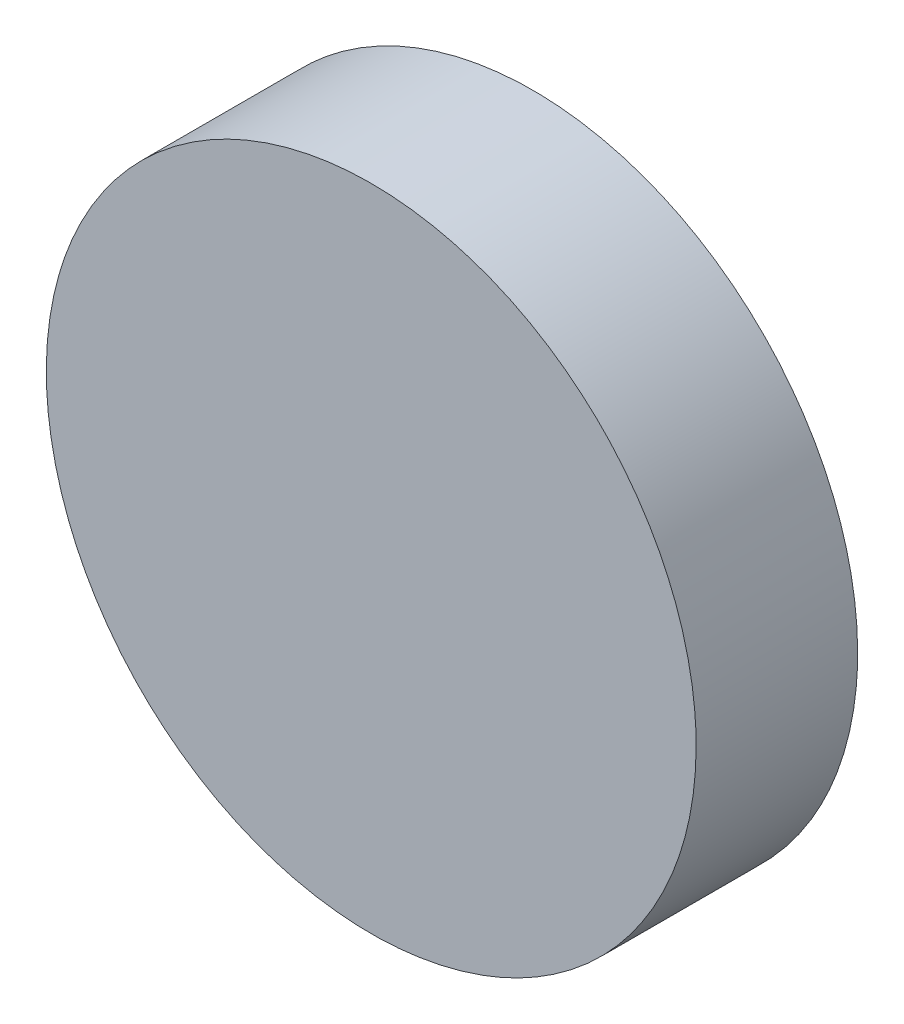
ISO-10303-21;
HEADER;
FILE_DESCRIPTION(('STEP AP214'),'2;1');
FILE_NAME('part.step','',(''),(''),'','','');
FILE_SCHEMA(('AUTOMOTIVE_DESIGN { 1 0 10303 214 1 1 1 1 }'));
ENDSEC;
DATA;
#1=APPLICATION_CONTEXT('core data for automotive mechanical design processes');
#2=APPLICATION_PROTOCOL_DEFINITION('international standard','automotive_design',2000,#1);
#3=PRODUCT_CONTEXT('',#1,'mechanical');
#4=PRODUCT('Part','Part','',(#3));
#5=PRODUCT_RELATED_PRODUCT_CATEGORY('part','',(#4));
#6=PRODUCT_DEFINITION_FORMATION('','',#4);
#7=PRODUCT_DEFINITION_CONTEXT('part definition',#1,'design');
#8=PRODUCT_DEFINITION('design','',#6,#7);
#9=PRODUCT_DEFINITION_SHAPE('','',#8);
#10=(LENGTH_UNIT() NAMED_UNIT(*) SI_UNIT(.MILLI.,.METRE.));
#11=(NAMED_UNIT(*) PLANE_ANGLE_UNIT() SI_UNIT($,.RADIAN.));
#12=(NAMED_UNIT(*) SI_UNIT($,.STERADIAN.) SOLID_ANGLE_UNIT());
#13=UNCERTAINTY_MEASURE_WITH_UNIT(LENGTH_MEASURE(1.E-05),#10,'distance_accuracy_value','');
#14=(GEOMETRIC_REPRESENTATION_CONTEXT(3) GLOBAL_UNCERTAINTY_ASSIGNED_CONTEXT((#13)) GLOBAL_UNIT_ASSIGNED_CONTEXT((#10,
#11,#12)) REPRESENTATION_CONTEXT('',''));
#15=CARTESIAN_POINT('',(0.,0.,0.));
#16=DIRECTION('',(0.,0.,1.));
#17=DIRECTION('',(1.,0.,0.));
#18=AXIS2_PLACEMENT_3D('',#15,#16,#17);
#19=CARTESIAN_POINT('',(-13.1496363943217,2.89844450659047,33.9766497664763));
#20=CARTESIAN_POINT('',(-13.1496363943217,3.16761247332292,33.9766497664763));
#21=CARTESIAN_POINT('',(-13.2567180692927,3.70594840678783,33.9766497664763));
#22=CARTESIAN_POINT('',(-13.7141322851876,4.39051715822122,33.9766497664763));
#23=CARTESIAN_POINT('',(-14.398701036621,4.8479313741161,33.9766497664763));
#24=CARTESIAN_POINT('',(-15.2062049368183,5.00855388657266,33.9766497664763));
#25=CARTESIAN_POINT('',(-16.0137088370157,4.8479313741161,33.9766497664763));
#26=CARTESIAN_POINT('',(-16.6982775884491,4.39051715822122,33.9766497664763));
#27=CARTESIAN_POINT('',(-17.155691804344,3.70594840678783,33.9766497664763));
#28=CARTESIAN_POINT('',(-17.3163143168005,2.89844450659047,33.9766497664763));
#29=CARTESIAN_POINT('',(-17.155691804344,2.09094060639311,33.9766497664763));
#30=CARTESIAN_POINT('',(-16.6982775884491,1.40637185495972,33.9766497664763));
#31=CARTESIAN_POINT('',(-16.0137088370157,0.948957639064841,33.9766497664763));
#32=CARTESIAN_POINT('',(-15.2062049368183,0.788335126608277,33.9766497664763));
#33=CARTESIAN_POINT('',(-14.398701036621,0.948957639064841,33.9766497664763));
#34=CARTESIAN_POINT('',(-13.7141322851876,1.40637185495972,33.9766497664763));
#35=CARTESIAN_POINT('',(-13.2567180692927,2.09094060639311,33.9766497664763));
#36=CARTESIAN_POINT('',(-13.1496363943217,2.62927653985802,33.9766497664763));
#37=CARTESIAN_POINT('',(-13.1496363943217,2.89844450659047,33.9766497664763));
#38=B_SPLINE_CURVE_WITH_KNOTS('',3,(#19,#20,#21,#22,#23,#24,#25,#26,#27,#28,#29,#30,#31,#32,#33,
#34,#35,#36,#37),.UNSPECIFIED.,.T.,.F.,(4,1,1,1,1,1,1,1,1,1,1,1,1,1,1,1,4),(0.,0.0625,0.125,
0.1875,0.25,0.3125,0.375,0.4375,0.5,0.5625,0.625,0.6875,0.75,0.8125,0.875,0.9375,1.),.UNSPECIFIED.);
#39=DIRECTION('',(0.,0.,1.));
#40=VECTOR('',#39,1.);
#41=SURFACE_OF_LINEAR_EXTRUSION('',#38,#40);
#42=CARTESIAN_POINT('',(-13.1496363943217,2.89844450659047,33.9766497664763));
#43=CARTESIAN_POINT('',(-13.1496363943217,3.16761247332292,33.9766497664763));
#44=CARTESIAN_POINT('',(-13.2567180692927,3.70594840678783,33.9766497664763));
#45=CARTESIAN_POINT('',(-13.7141322851876,4.39051715822122,33.9766497664763));
#46=CARTESIAN_POINT('',(-14.398701036621,4.8479313741161,33.9766497664763));
#47=CARTESIAN_POINT('',(-15.2062049368183,5.00855388657266,33.9766497664763));
#48=CARTESIAN_POINT('',(-16.0137088370157,4.8479313741161,33.9766497664763));
#49=CARTESIAN_POINT('',(-16.6982775884491,4.39051715822122,33.9766497664763));
#50=CARTESIAN_POINT('',(-17.155691804344,3.70594840678783,33.9766497664763));
#51=CARTESIAN_POINT('',(-17.3163143168005,2.89844450659047,33.9766497664763));
#52=CARTESIAN_POINT('',(-17.155691804344,2.09094060639311,33.9766497664763));
#53=CARTESIAN_POINT('',(-16.6982775884491,1.40637185495972,33.9766497664763));
#54=CARTESIAN_POINT('',(-16.0137088370157,0.948957639064841,33.9766497664763));
#55=CARTESIAN_POINT('',(-15.2062049368183,0.788335126608277,33.9766497664763));
#56=CARTESIAN_POINT('',(-14.398701036621,0.948957639064841,33.9766497664763));
#57=CARTESIAN_POINT('',(-13.7141322851876,1.40637185495972,33.9766497664763));
#58=CARTESIAN_POINT('',(-13.2567180692927,2.09094060639311,33.9766497664763));
#59=CARTESIAN_POINT('',(-13.1496363943217,2.62927653985802,33.9766497664763));
#60=CARTESIAN_POINT('',(-13.1496363943217,2.89844450659047,33.9766497664763));
#61=B_SPLINE_CURVE_WITH_KNOTS('',3,(#42,#43,#44,#45,#46,#47,#48,#49,#50,#51,#52,#53,#54,#55,#56,
#57,#58,#59,#60),.UNSPECIFIED.,.T.,.F.,(4,1,1,1,1,1,1,1,1,1,1,1,1,1,1,1,4),(0.,0.0625,0.125,
0.1875,0.25,0.3125,0.375,0.4375,0.5,0.5625,0.625,0.6875,0.75,0.8125,0.875,0.9375,1.),.UNSPECIFIED.);
#62=CARTESIAN_POINT('',(-13.1496363943217,2.89844450659047,33.9766497664763));
#63=VERTEX_POINT('',#62);
#64=EDGE_CURVE('E9',#63,#63,#61,.T.);
#65=ORIENTED_EDGE('',*,*,#64,.T.);
#66=EDGE_LOOP('',(#65));
#67=FACE_BOUND('',#66,.T.);
#68=CARTESIAN_POINT('',(-13.1496363943217,2.89844450659047,34.9990000000068));
#69=CARTESIAN_POINT('',(-13.1496363699629,2.86479771684749,34.9990000000068));
#70=CARTESIAN_POINT('',(-13.1504730064724,2.83115162548501,34.9990000000068));
#71=CARTESIAN_POINT('',(-13.1538034135198,2.76393947146804,34.9990000000068));
#72=CARTESIAN_POINT('',(-13.1562972815486,2.73037341363833,34.9990000000068));
#73=CARTESIAN_POINT('',(-13.1629261875652,2.66340163862288,34.9990000000068));
#74=CARTESIAN_POINT('',(-13.1670613381745,2.62999593259941,34.9990000000068));
#75=CARTESIAN_POINT('',(-13.1769569019658,2.56342468915356,34.9990000000068));
#76=CARTESIAN_POINT('',(-13.1827173852433,2.53025916215264,34.9990000000068));
#77=CARTESIAN_POINT('',(-13.1958477712335,2.46424824869611,34.9990000000068));
#78=CARTESIAN_POINT('',(-13.2032176739464,2.43140286224051,34.9990000000068));
#79=CARTESIAN_POINT('',(-13.2195510839073,2.36611217178674,34.9990000000068));
#80=CARTESIAN_POINT('',(-13.2285145224069,2.33366685059351,34.9990000000068));
#81=CARTESIAN_POINT('',(-13.2480191751394,2.26925627775602,34.9990000000068));
#82=CARTESIAN_POINT('',(-13.2585602810548,2.23729099331971,34.9990000000068));
#83=CARTESIAN_POINT('',(-13.2812044587058,2.17392037371882,34.9990000000068));
#84=CARTESIAN_POINT('',(-13.2933074385154,2.14251500572341,34.9990000000068));
#85=CARTESIAN_POINT('',(-13.3190592678828,2.08034458998414,34.9990000000068));
#86=CARTESIAN_POINT('',(-13.3327081174406,2.04957954224029,34.9990000000068));
#87=CARTESIAN_POINT('',(-13.3615060607773,1.98875789577373,34.9990000000068));
#88=CARTESIAN_POINT('',(-13.3766552427726,1.95870133883757,34.9990000000068));
#89=CARTESIAN_POINT('',(-13.4084085231704,1.89936431398903,34.9990000000068));
#90=CARTESIAN_POINT('',(-13.4250127213523,1.87008389948112,34.9990000000068));
#91=CARTESIAN_POINT('',(-13.4596307472126,1.8123669438299,34.9990000000068));
#92=CARTESIAN_POINT('',(-13.4776446356623,1.78393043914022,34.9990000000068));
#93=CARTESIAN_POINT('',(-13.5150368121087,1.72796909239188,34.9990000000068));
#94=CARTESIAN_POINT('',(-13.5344151001053,1.70044425033323,34.9990000000068));
#95=CARTESIAN_POINT('',(-13.5744908691528,1.64637404209053,34.9990000000068));
#96=CARTESIAN_POINT('',(-13.5951882932687,1.61982863371135,34.9990000000068));
#97=CARTESIAN_POINT('',(-13.6378571017135,1.56778513152689,34.9990000000068));
#98=CARTESIAN_POINT('',(-13.6598283985191,1.54228696597445,34.9990000000068));
#99=CARTESIAN_POINT('',(-13.7049997770275,1.49240569911345,34.9990000000068));
#100=CARTESIAN_POINT('',(-13.7281997863655,1.46802253229461,34.9990000000068));
#101=CARTESIAN_POINT('',(-13.7757829625225,1.42043935613767,34.9990000000068));
#102=CARTESIAN_POINT('',(-13.8001661293413,1.39723934679959,34.9990000000068));
#103=CARTESIAN_POINT('',(-13.8500473962023,1.3520679682912,34.9990000000068));
#104=CARTESIAN_POINT('',(-13.8755455617548,1.33009667148559,34.9990000000068));
#105=CARTESIAN_POINT('',(-13.9275890639392,1.28742786304083,34.9990000000068));
#106=CARTESIAN_POINT('',(-13.9541344723184,1.26673043892492,34.9990000000068));
#107=CARTESIAN_POINT('',(-14.0082046805611,1.22665466987745,34.9990000000068));
#108=CARTESIAN_POINT('',(-14.0357295226198,1.20727638188081,34.9990000000068));
#109=CARTESIAN_POINT('',(-14.091690869368,1.16988420543445,34.9990000000068));
#110=CARTESIAN_POINT('',(-14.1201273740576,1.15187031698473,34.9990000000068));
#111=CARTESIAN_POINT('',(-14.1778443297092,1.1172522911244,34.9990000000068));
#112=CARTESIAN_POINT('',(-14.2071247442177,1.10064809294253,34.9990000000068));
#113=CARTESIAN_POINT('',(-14.2664617690647,1.06889481254468,34.9990000000068));
#114=CARTESIAN_POINT('',(-14.2965183259987,1.05374563054928,34.9990000000068));
#115=CARTESIAN_POINT('',(-14.357339972471,1.02494768721292,34.9990000000068));
#116=CARTESIAN_POINT('',(-14.3881050202227,1.01129883765558,34.9990000000068));
#117=CARTESIAN_POINT('',(-14.4502754359406,0.985547008286876,34.9990000000068));
#118=CARTESIAN_POINT('',(-14.4816808039067,0.973444028475515,34.9990000000068));
#119=CARTESIAN_POINT('',(-14.5450514235876,0.950799850829384,34.9990000000068));
#120=CARTESIAN_POINT('',(-14.5770167081331,0.940258744920572,34.9990000000068));
#121=CARTESIAN_POINT('',(-14.6414272806721,0.920754092170061,34.9990000000068));
#122=CARTESIAN_POINT('',(-14.6738726014576,0.911790653645731,34.9990000000068));
#123=CARTESIAN_POINT('',(-14.7391632930254,0.895457243752155,34.9990000000068));
#124=CARTESIAN_POINT('',(-14.772008681003,0.888087341131276,34.9990000000068));
#125=CARTESIAN_POINT('',(-14.8380195903015,0.874956954889819,34.9990000000068));
#126=CARTESIAN_POINT('',(-14.8711851116225,0.869196471269239,34.9990000000068));
#127=CARTESIAN_POINT('',(-14.9377563705859,0.85930090841536,34.9990000000068));
#128=CARTESIAN_POINT('',(-14.9711620978056,0.855165759086547,34.9990000000068));
#129=CARTESIAN_POINT('',(-15.0381338149133,0.84853684957166,34.9990000000068));
#130=CARTESIAN_POINT('',(-15.071699793646,0.846042976764422,34.9990000000068));
#131=CARTESIAN_POINT('',(-15.1389121637564,0.842712582771656,34.9990000000068));
#132=CARTESIAN_POINT('',(-15.1725585502874,0.841875964093798,34.9990000000068));
#133=CARTESIAN_POINT('',(-15.2398513233493,0.841875964093798,34.9990000000068));
#134=CARTESIAN_POINT('',(-15.2734977098803,0.842712582771656,34.9990000000068));
#135=CARTESIAN_POINT('',(-15.3407100799907,0.846042976764422,34.9990000000068));
#136=CARTESIAN_POINT('',(-15.3742760587233,0.84853684957166,34.9990000000068));
#137=CARTESIAN_POINT('',(-15.4412477758311,0.855165759086547,34.9990000000068));
#138=CARTESIAN_POINT('',(-15.4746535030508,0.85930090841536,34.9990000000068));
#139=CARTESIAN_POINT('',(-15.5412247620142,0.869196471269239,34.9990000000068));
#140=CARTESIAN_POINT('',(-15.5743902833352,0.874956954889818,34.9990000000068));
#141=CARTESIAN_POINT('',(-15.6404011926337,0.888087341131276,34.9990000000068));
#142=CARTESIAN_POINT('',(-15.6732465806113,0.895457243752154,34.9990000000068));
#143=CARTESIAN_POINT('',(-15.7385372721791,0.911790653645731,34.9990000000068));
#144=CARTESIAN_POINT('',(-15.7709825929646,0.920754092170061,34.9990000000068));
#145=CARTESIAN_POINT('',(-15.8353931655035,0.940258744920571,34.9990000000068));
#146=CARTESIAN_POINT('',(-15.8673584500491,0.950799850829384,34.9990000000068));
#147=CARTESIAN_POINT('',(-15.93072906973,0.973444028475515,34.9990000000068));
#148=CARTESIAN_POINT('',(-15.9621344376961,0.985547008286875,34.9990000000068));
#149=CARTESIAN_POINT('',(-16.024304853414,1.01129883765558,34.9990000000068));
#150=CARTESIAN_POINT('',(-16.0550699011656,1.02494768721292,34.9990000000068));
#151=CARTESIAN_POINT('',(-16.115891547638,1.05374563054928,34.9990000000068));
#152=CARTESIAN_POINT('',(-16.145948104572,1.06889481254468,34.9990000000068));
#153=CARTESIAN_POINT('',(-16.205285129419,1.10064809294253,34.9990000000068));
#154=CARTESIAN_POINT('',(-16.2345655439275,1.1172522911244,34.9990000000068));
#155=CARTESIAN_POINT('',(-16.2922824995791,1.15187031698473,34.9990000000068));
#156=CARTESIAN_POINT('',(-16.3207190042686,1.16988420543445,34.9990000000068));
#157=CARTESIAN_POINT('',(-16.3766803510169,1.20727638188081,34.9990000000068));
#158=CARTESIAN_POINT('',(-16.4042051930756,1.22665466987745,34.9990000000068));
#159=CARTESIAN_POINT('',(-16.4582754013183,1.26673043892492,34.9990000000068));
#160=CARTESIAN_POINT('',(-16.4848208096975,1.28742786304083,34.9990000000068));
#161=CARTESIAN_POINT('',(-16.5368643118819,1.33009667148559,34.9990000000068));
#162=CARTESIAN_POINT('',(-16.5623624774344,1.3520679682912,34.9990000000068));
#163=CARTESIAN_POINT('',(-16.6122437442954,1.39723934679959,34.9990000000068));
#164=CARTESIAN_POINT('',(-16.6366269111142,1.42043935613767,34.9990000000068));
#165=CARTESIAN_POINT('',(-16.6842100872711,1.46802253229461,34.9990000000068));
#166=CARTESIAN_POINT('',(-16.7074100966092,1.49240569911345,34.9990000000068));
#167=CARTESIAN_POINT('',(-16.7525814751176,1.54228696597445,34.9990000000068));
#168=CARTESIAN_POINT('',(-16.7745527719232,1.56778513152689,34.9990000000068));
#169=CARTESIAN_POINT('',(-16.817221580368,1.61982863371135,34.9990000000068));
#170=CARTESIAN_POINT('',(-16.8379190044839,1.64637404209051,34.9990000000068));
#171=CARTESIAN_POINT('',(-16.8779947735314,1.70044425033325,34.9990000000068));
#172=CARTESIAN_POINT('',(-16.897373061528,1.72796909239194,34.9990000000068));
#173=CARTESIAN_POINT('',(-16.9347652379744,1.78393043914016,34.9990000000068));
#174=CARTESIAN_POINT('',(-16.9527791264241,1.8123669438297,34.9990000000068));
#175=CARTESIAN_POINT('',(-16.9873971522844,1.87008389948133,34.9990000000068));
#176=CARTESIAN_POINT('',(-17.0040013504663,1.8993643139898,34.9990000000068));
#177=CARTESIAN_POINT('',(-17.0357546308641,1.9587013388368,34.9990000000068));
#178=CARTESIAN_POINT('',(-17.0509038128595,1.98875789577086,34.9990000000068));
#179=CARTESIAN_POINT('',(-17.0797017561959,2.04957954224316,34.9990000000068));
#180=CARTESIAN_POINT('',(-17.0933506057532,2.08034458999486,34.9990000000068));
#181=CARTESIAN_POINT('',(-17.1191024351219,2.14251500571269,34.9990000000068));
#182=CARTESIAN_POINT('',(-17.1312054149333,2.17392037367883,34.9990000000068));
#183=CARTESIAN_POINT('',(-17.1538495925794,2.2372909933597,34.9990000000068));
#184=CARTESIAN_POINT('',(-17.1643906984882,2.26925627790526,34.9990000000068));
#185=CARTESIAN_POINT('',(-17.1838953512387,2.33366685044426,34.9990000000068));
#186=CARTESIAN_POINT('',(-17.1928587897631,2.36611217122972,34.9990000000068));
#187=CARTESIAN_POINT('',(-17.2091921996567,2.43140286279756,34.9990000000068));
#188=CARTESIAN_POINT('',(-17.2165621022775,2.4642482507751,34.9990000000068));
#189=CARTESIAN_POINT('',(-17.229692488519,2.53025916007365,34.9990000000068));
#190=CARTESIAN_POINT('',(-17.2354529721396,2.56342468139465,34.9990000000068));
#191=CARTESIAN_POINT('',(-17.2453485349934,2.62999594035798,34.9990000000068));
#192=CARTESIAN_POINT('',(-17.2494836843223,2.66340166757772,34.9990000000068));
#193=CARTESIAN_POINT('',(-17.2561125938372,2.73037338468548,34.9990000000068));
#194=CARTESIAN_POINT('',(-17.2586064666444,2.76393936341814,34.9990000000068));
#195=CARTESIAN_POINT('',(-17.2619368606372,2.83115173352855,34.9990000000068));
#196=CARTESIAN_POINT('',(-17.262773479315,2.86479812005951,34.9990000000068));
#197=CARTESIAN_POINT('',(-17.262773479315,2.93209089312143,34.9990000000068));
#198=CARTESIAN_POINT('',(-17.2619368606372,2.96573727965239,34.9990000000068));
#199=CARTESIAN_POINT('',(-17.2586064666444,3.0329496497628,34.9990000000068));
#200=CARTESIAN_POINT('',(-17.2561125938372,3.06651562849546,34.9990000000068));
#201=CARTESIAN_POINT('',(-17.2494836843223,3.13348734560323,34.9990000000068));
#202=CARTESIAN_POINT('',(-17.2453485349935,3.16689307282296,34.9990000000068));
#203=CARTESIAN_POINT('',(-17.2354529721396,3.23346433178629,34.9990000000068));
#204=CARTESIAN_POINT('',(-17.229692488519,3.26662985310729,34.9990000000068));
#205=CARTESIAN_POINT('',(-17.2165621022775,3.33264076240584,34.9990000000068));
#206=CARTESIAN_POINT('',(-17.2091921996567,3.36548615038338,34.9990000000068));
#207=CARTESIAN_POINT('',(-17.1928587897631,3.43077684195123,34.9990000000068));
#208=CARTESIAN_POINT('',(-17.1838953512387,3.46322216273668,34.9990000000068));
#209=CARTESIAN_POINT('',(-17.1643906984882,3.52763273527568,34.9990000000068));
#210=CARTESIAN_POINT('',(-17.1538495925794,3.55959801982124,34.9990000000068));
#211=CARTESIAN_POINT('',(-17.1312054149333,3.62296863950211,34.9990000000068));
#212=CARTESIAN_POINT('',(-17.1191024351219,3.65437400746825,34.9990000000068));
#213=CARTESIAN_POINT('',(-17.0933506057532,3.71654442318609,34.9990000000068));
#214=CARTESIAN_POINT('',(-17.0797017561959,3.74730947093778,34.9990000000068));
#215=CARTESIAN_POINT('',(-17.0509038128595,3.80813111741008,34.9990000000068));
#216=CARTESIAN_POINT('',(-17.0357546308641,3.83818767434414,34.9990000000068));
#217=CARTESIAN_POINT('',(-17.0040013504663,3.89752469919114,34.9990000000068));
#218=CARTESIAN_POINT('',(-16.9873971522844,3.92680511369961,34.9990000000068));
#219=CARTESIAN_POINT('',(-16.9527791264241,3.98452206935124,34.9990000000068));
#220=CARTESIAN_POINT('',(-16.9347652379744,4.01295857404078,34.9990000000068));
#221=CARTESIAN_POINT('',(-16.897373061528,4.068919920789,34.9990000000068));
#222=CARTESIAN_POINT('',(-16.8779947735314,4.09644476284769,34.9990000000068));
#223=CARTESIAN_POINT('',(-16.8379190044839,4.15051497109043,34.9990000000068));
#224=CARTESIAN_POINT('',(-16.817221580368,4.17706037946959,34.9990000000068));
#225=CARTESIAN_POINT('',(-16.7745527719232,4.22910388165405,34.9990000000068));
#226=CARTESIAN_POINT('',(-16.7525814751176,4.25460204720649,34.9990000000068));
#227=CARTESIAN_POINT('',(-16.7074100966092,4.30448331406749,34.9990000000068));
#228=CARTESIAN_POINT('',(-16.6842100872711,4.32886648088633,34.9990000000068));
#229=CARTESIAN_POINT('',(-16.6366269111142,4.37644965704327,34.9990000000068));
#230=CARTESIAN_POINT('',(-16.6122437442954,4.39964966638135,34.9990000000068));
#231=CARTESIAN_POINT('',(-16.5623624774344,4.44482104488974,34.9990000000068));
#232=CARTESIAN_POINT('',(-16.5368643118819,4.46679234169535,34.9990000000068));
#233=CARTESIAN_POINT('',(-16.4848208096975,4.50946115014011,34.9990000000068));
#234=CARTESIAN_POINT('',(-16.4582754013183,4.53015857425602,34.9990000000068));
#235=CARTESIAN_POINT('',(-16.4042051930756,4.57023434330349,34.9990000000068));
#236=CARTESIAN_POINT('',(-16.3766803510169,4.58961263130013,34.9990000000068));
#237=CARTESIAN_POINT('',(-16.3207190042686,4.62700480774649,34.9990000000068));
#238=CARTESIAN_POINT('',(-16.2922824995791,4.64501869619621,34.9990000000068));
#239=CARTESIAN_POINT('',(-16.2345655439275,4.67963672205654,34.9990000000068));
#240=CARTESIAN_POINT('',(-16.205285129419,4.69624092023841,34.9990000000068));
#241=CARTESIAN_POINT('',(-16.145948104572,4.72799420063626,34.9990000000068));
#242=CARTESIAN_POINT('',(-16.115891547638,4.74314338263166,34.9990000000068));
#243=CARTESIAN_POINT('',(-16.0550699011656,4.77194132596803,34.9990000000068));
#244=CARTESIAN_POINT('',(-16.024304853414,4.78559017552536,34.9990000000068));
#245=CARTESIAN_POINT('',(-15.9621344376961,4.81134200489407,34.9990000000068));
#246=CARTESIAN_POINT('',(-15.93072906973,4.82344498470543,34.9990000000068));
#247=CARTESIAN_POINT('',(-15.8673584500491,4.84608916235156,34.9990000000068));
#248=CARTESIAN_POINT('',(-15.8353931655035,4.85663026826037,34.9990000000068));
#249=CARTESIAN_POINT('',(-15.7709825929646,4.87613492101088,34.9990000000068));
#250=CARTESIAN_POINT('',(-15.7385372721791,4.88509835953521,34.9990000000068));
#251=CARTESIAN_POINT('',(-15.6732465806113,4.90143176942879,34.9990000000068));
#252=CARTESIAN_POINT('',(-15.6404011926337,4.90880167204967,34.9990000000068));
#253=CARTESIAN_POINT('',(-15.5743902833352,4.92193205829112,34.9990000000068));
#254=CARTESIAN_POINT('',(-15.5412247620142,4.9276925419117,34.9990000000068));
#255=CARTESIAN_POINT('',(-15.4746535030508,4.93758810476558,34.9990000000068));
#256=CARTESIAN_POINT('',(-15.4412477758311,4.94172325409439,34.9990000000068));
#257=CARTESIAN_POINT('',(-15.3742760587233,4.94835216360928,34.9990000000068));
#258=CARTESIAN_POINT('',(-15.3407100799907,4.95084603641652,34.9990000000068));
#259=CARTESIAN_POINT('',(-15.2734977098803,4.95417643040929,34.9990000000068));
#260=CARTESIAN_POINT('',(-15.2398513233493,4.95501304908714,34.9990000000068));
#261=CARTESIAN_POINT('',(-15.1725585502874,4.95501304908714,34.9990000000068));
#262=CARTESIAN_POINT('',(-15.1389121637564,4.95417643040928,34.9990000000068));
#263=CARTESIAN_POINT('',(-15.071699793646,4.95084603641652,34.9990000000068));
#264=CARTESIAN_POINT('',(-15.0381338149133,4.94835216360928,34.9990000000068));
#265=CARTESIAN_POINT('',(-14.9711620978056,4.94172325409439,34.9990000000068));
#266=CARTESIAN_POINT('',(-14.9377563705859,4.93758810476558,34.9990000000068));
#267=CARTESIAN_POINT('',(-14.8711851116225,4.9276925419117,34.9990000000068));
#268=CARTESIAN_POINT('',(-14.8380195903015,4.92193205829112,34.9990000000068));
#269=CARTESIAN_POINT('',(-14.772008681003,4.90880167204967,34.9990000000068));
#270=CARTESIAN_POINT('',(-14.7391632930254,4.90143176942879,34.9990000000068));
#271=CARTESIAN_POINT('',(-14.6738726014576,4.88509835953521,34.9990000000068));
#272=CARTESIAN_POINT('',(-14.6414272806721,4.87613492101088,34.9990000000068));
#273=CARTESIAN_POINT('',(-14.5770167081331,4.85663026826037,34.9990000000068));
#274=CARTESIAN_POINT('',(-14.5450514235876,4.84608916235156,34.9990000000068));
#275=CARTESIAN_POINT('',(-14.4816808039067,4.82344498470543,34.9990000000068));
#276=CARTESIAN_POINT('',(-14.4502754359406,4.81134200489407,34.9990000000068));
#277=CARTESIAN_POINT('',(-14.3881050202227,4.78559017552537,34.9990000000068));
#278=CARTESIAN_POINT('',(-14.357339972471,4.77194132596803,34.9990000000068));
#279=CARTESIAN_POINT('',(-14.2965183259987,4.74314338263166,34.9990000000068));
#280=CARTESIAN_POINT('',(-14.2664617690647,4.72799420063626,34.9990000000068));
#281=CARTESIAN_POINT('',(-14.2071247442177,4.69624092023841,34.9990000000068));
#282=CARTESIAN_POINT('',(-14.1778443297092,4.67963672205654,34.9990000000068));
#283=CARTESIAN_POINT('',(-14.1201273740576,4.64501869619621,34.9990000000068));
#284=CARTESIAN_POINT('',(-14.091690869368,4.62700480774649,34.9990000000068));
#285=CARTESIAN_POINT('',(-14.0357295226198,4.58961263130013,34.9990000000068));
#286=CARTESIAN_POINT('',(-14.0082046805611,4.57023434330349,34.9990000000068));
#287=CARTESIAN_POINT('',(-13.9541344723184,4.53015857425603,34.9990000000068));
#288=CARTESIAN_POINT('',(-13.9275890639392,4.50946115014011,34.9990000000068));
#289=CARTESIAN_POINT('',(-13.8755455617548,4.46679234169535,34.9990000000068));
#290=CARTESIAN_POINT('',(-13.8500473962023,4.44482104488974,34.9990000000068));
#291=CARTESIAN_POINT('',(-13.8001661293413,4.39964966638136,34.9990000000068));
#292=CARTESIAN_POINT('',(-13.7757829625225,4.37644965704327,34.9990000000068));
#293=CARTESIAN_POINT('',(-13.7281997863655,4.32886648088634,34.9990000000068));
#294=CARTESIAN_POINT('',(-13.7049997770275,4.30448331406749,34.9990000000068));
#295=CARTESIAN_POINT('',(-13.6598283985191,4.25460204720649,34.9990000000068));
#296=CARTESIAN_POINT('',(-13.6378571017135,4.22910388165405,34.9990000000068));
#297=CARTESIAN_POINT('',(-13.5951882932687,4.17706037946959,34.9990000000068));
#298=CARTESIAN_POINT('',(-13.5744908691528,4.15051497109042,34.9990000000068));
#299=CARTESIAN_POINT('',(-13.5344151001053,4.09644476284771,34.9990000000068));
#300=CARTESIAN_POINT('',(-13.5150368121087,4.06891992078906,34.9990000000068));
#301=CARTESIAN_POINT('',(-13.4776446356623,4.01295857404072,34.9990000000068));
#302=CARTESIAN_POINT('',(-13.4596307472126,3.98452206935104,34.9990000000068));
#303=CARTESIAN_POINT('',(-13.4250127213523,3.92680511369982,34.9990000000068));
#304=CARTESIAN_POINT('',(-13.4084085231704,3.89752469919191,34.9990000000068));
#305=CARTESIAN_POINT('',(-13.3766552427726,3.83818767434337,34.9990000000068));
#306=CARTESIAN_POINT('',(-13.3615060607773,3.80813111740721,34.9990000000068));
#307=CARTESIAN_POINT('',(-13.3327081174406,3.74730947094065,34.9990000000068));
#308=CARTESIAN_POINT('',(-13.3190592678828,3.7165444231968,34.9990000000068));
#309=CARTESIAN_POINT('',(-13.2933074385154,3.65437400745754,34.9990000000068));
#310=CARTESIAN_POINT('',(-13.2812044587058,3.62296863946212,34.9990000000068));
#311=CARTESIAN_POINT('',(-13.2585602810548,3.55959801986123,34.9990000000068));
#312=CARTESIAN_POINT('',(-13.2480191751394,3.52763273542492,34.9990000000068));
#313=CARTESIAN_POINT('',(-13.2285145224069,3.46322216258743,34.9990000000068));
#314=CARTESIAN_POINT('',(-13.2195510839073,3.4307768413942,34.9990000000068));
#315=CARTESIAN_POINT('',(-13.2032176739464,3.36548615094044,34.9990000000068));
#316=CARTESIAN_POINT('',(-13.1958477712335,3.33264076448483,34.9990000000068));
#317=CARTESIAN_POINT('',(-13.1827173852433,3.2666298510283,34.9990000000068));
#318=CARTESIAN_POINT('',(-13.1769569019658,3.23346432402738,34.9990000000068));
#319=CARTESIAN_POINT('',(-13.1670613381745,3.16689308058154,34.9990000000068));
#320=CARTESIAN_POINT('',(-13.1629261875652,3.13348737455806,34.9990000000068));
#321=CARTESIAN_POINT('',(-13.1562972815486,3.06651559954261,34.9990000000068));
#322=CARTESIAN_POINT('',(-13.1538034135198,3.03294954171291,34.9990000000068));
#323=CARTESIAN_POINT('',(-13.1504730064724,2.96573738769594,34.9990000000068));
#324=CARTESIAN_POINT('',(-13.1496363699629,2.93209129633345,34.9990000000068));
#325=CARTESIAN_POINT('',(-13.1496363943217,2.89844450659047,34.9990000000068));
#326=B_SPLINE_CURVE_WITH_KNOTS('',3,(#68,#69,#70,#71,#72,#73,#74,#75,#76,#77,#78,#79,#80,#81,
#82,#83,#84,#85,#86,#87,#88,#89,#90,#91,#92,#93,#94,#95,#96,#97,#98,#99,#100,#101,#102,#103,
#104,#105,#106,#107,#108,#109,#110,#111,#112,#113,#114,#115,#116,#117,#118,#119,#120,#121,#122,
#123,#124,#125,#126,#127,#128,#129,#130,#131,#132,#133,#134,#135,#136,#137,#138,#139,#140,#141,
#142,#143,#144,#145,#146,#147,#148,#149,#150,#151,#152,#153,#154,#155,#156,#157,#158,#159,#160,
#161,#162,#163,#164,#165,#166,#167,#168,#169,#170,#171,#172,#173,#174,#175,#176,#177,#178,#179,
#180,#181,#182,#183,#184,#185,#186,#187,#188,#189,#190,#191,#192,#193,#194,#195,#196,#197,#198,
#199,#200,#201,#202,#203,#204,#205,#206,#207,#208,#209,#210,#211,#212,#213,#214,#215,#216,#217,
#218,#219,#220,#221,#222,#223,#224,#225,#226,#227,#228,#229,#230,#231,#232,#233,#234,#235,#236,
#237,#238,#239,#240,#241,#242,#243,#244,#245,#246,#247,#248,#249,#250,#251,#252,#253,#254,#255,
#256,#257,#258,#259,#260,#261,#262,#263,#264,#265,#266,#267,#268,#269,#270,#271,#272,#273,#274,
#275,#276,#277,#278,#279,#280,#281,#282,#283,#284,#285,#286,#287,#288,#289,#290,#291,#292,#293,
#294,#295,#296,#297,#298,#299,#300,#301,#302,#303,#304,#305,#306,#307,#308,#309,#310,#311,#312,
#313,#314,#315,#316,#317,#318,#319,#320,#321,#322,#323,#324,#325),.UNSPECIFIED.,.F.,.F.,(4,2,2,
2,2,2,2,2,2,2,2,2,2,2,2,2,2,2,2,2,2,2,2,2,2,2,2,2,2,2,2,2,2,2,2,2,2,2,2,2,2,2,2,2,2,2,2,2,2,2,2,
2,2,2,2,2,2,2,2,2,2,2,2,2,2,2,2,2,2,2,2,2,2,2,2,2,2,2,2,2,2,2,2,2,2,2,2,2,2,2,2,2,2,2,2,2,2,2,2,
2,2,2,2,2,2,2,2,2,2,2,2,2,2,2,2,2,2,2,2,2,2,2,2,2,2,2,2,2,4),(0.,0.100928980478611,
0.201863898895515,0.302805744465615,0.403751944002991,0.504698143540367,0.605639989110467,
0.706574907527371,0.807503888005981,0.908432868484594,1.0093677869015,1.1103096324716,
1.21125583200897,1.31220203154635,1.41314387711645,1.51407879553335,1.61500777601196,
1.71593675649058,1.81687167490748,1.91781352047758,2.01875972001496,2.11970591955233,
2.22064776512243,2.32158268353933,2.42251166401795,2.52344064449656,2.62437556291346,
2.72531740848356,2.82626360802094,2.92720980755831,3.02815165312841,3.12908657154532,
3.23001555202393,3.33094453250254,3.43187945091944,3.53282129648954,3.63376749602692,
3.7347136955643,3.8356555411344,3.9365904595513,4.03751944002991,4.13844842050852,
4.23938333892542,4.34032518449553,4.4412713840329,4.54221758357028,4.64315942914038,
4.74409434755729,4.84502332803589,4.9459523085145,5.04688722693141,5.14782907250151,
5.24877527203888,5.34972147157626,5.45066331714636,5.55159823556326,5.65252721604187,
5.75345619652049,5.85439111493739,5.95533296050749,6.05627916004487,6.15722535958224,
6.25816720515234,6.35910212356925,6.46003110404786,6.56096008452647,6.66189500294337,
6.76283684851347,6.86378304805085,6.96472924758823,7.06567109315833,7.16660601157523,
7.26753499205384,7.36846397253245,7.46939889094936,7.57034073651946,7.67128693605683,
7.77223313559421,7.87317498116431,7.97410989958121,8.07503888005982,8.17596786053844,
8.27690277895534,8.37784462452544,8.47879082406281,8.57973702360019,8.68067886917029,
8.7816137875872,8.8825427680658,8.98347174854441,9.08440666696132,9.18534851253142,
9.2862947120688,9.38724091160618,9.48818275717627,9.58911767559318,9.69004665607179,
9.7909756365504,9.8919105549673,9.9928524005374,10.0937986000748,10.1947447996122,
10.2956866451823,10.3966215635992,10.4975505440778,10.5984795245564,10.6994144429733,
10.8003562885434,10.9013024880808,11.0022486876181,11.1031905331882,11.2041254516051,
11.3050544320838,11.4059834125624,11.5069183309793,11.6078601765494,11.7088063760867,
11.8097525756241,11.9106944211942,12.0116293396111,12.1125583200897,12.2134873005683,
12.3144222189853,12.4153640645554,12.5163102640927,12.6172564636301,12.7181983092002,
12.8191332276171,12.9200622080957),.UNSPECIFIED.);
#327=CARTESIAN_POINT('',(-13.1496363943217,2.89844450659047,34.9990000000068));
#328=VERTEX_POINT('',#327);
#329=EDGE_CURVE('E24',#328,#328,#326,.F.);
#330=ORIENTED_EDGE('',*,*,#329,.F.);
#331=EDGE_LOOP('',(#330));
#332=FACE_BOUND('',#331,.T.);
#333=ADVANCED_FACE('F14',(#67,#332),#41,.T.);
#334=CARTESIAN_POINT('',(-11.7062049368191,2.89844450659127,33.9766497664763));
#335=DIRECTION('',(0.,0.,1.));
#336=DIRECTION('',(0.,-1.,0.));
#337=AXIS2_PLACEMENT_3D('',#334,#335,#336);
#338=PLANE('',#337);
#339=ORIENTED_EDGE('',*,*,#64,.F.);
#340=EDGE_LOOP('',(#339));
#341=FACE_BOUND('',#340,.T.);
#342=ADVANCED_FACE('F62',(#341),#338,.F.);
#343=CARTESIAN_POINT('',(-11.7062049368191,2.89844450659127,34.9990000000068));
#344=DIRECTION('',(0.,0.,1.));
#345=DIRECTION('',(0.,-1.,0.));
#346=AXIS2_PLACEMENT_3D('',#343,#344,#345);
#347=PLANE('',#346);
#348=ORIENTED_EDGE('',*,*,#329,.T.);
#349=EDGE_LOOP('',(#348));
#350=FACE_BOUND('',#349,.T.);
#351=ADVANCED_FACE('F31',(#350),#347,.T.);
#352=CLOSED_SHELL('',(#333,#342,#351));
#353=MANIFOLD_SOLID_BREP('B1',#352);
#354=ADVANCED_BREP_SHAPE_REPRESENTATION('',(#18,#353),#14);
#355=SHAPE_DEFINITION_REPRESENTATION(#9,#354);
ENDSEC;
END-ISO-10303-21;
